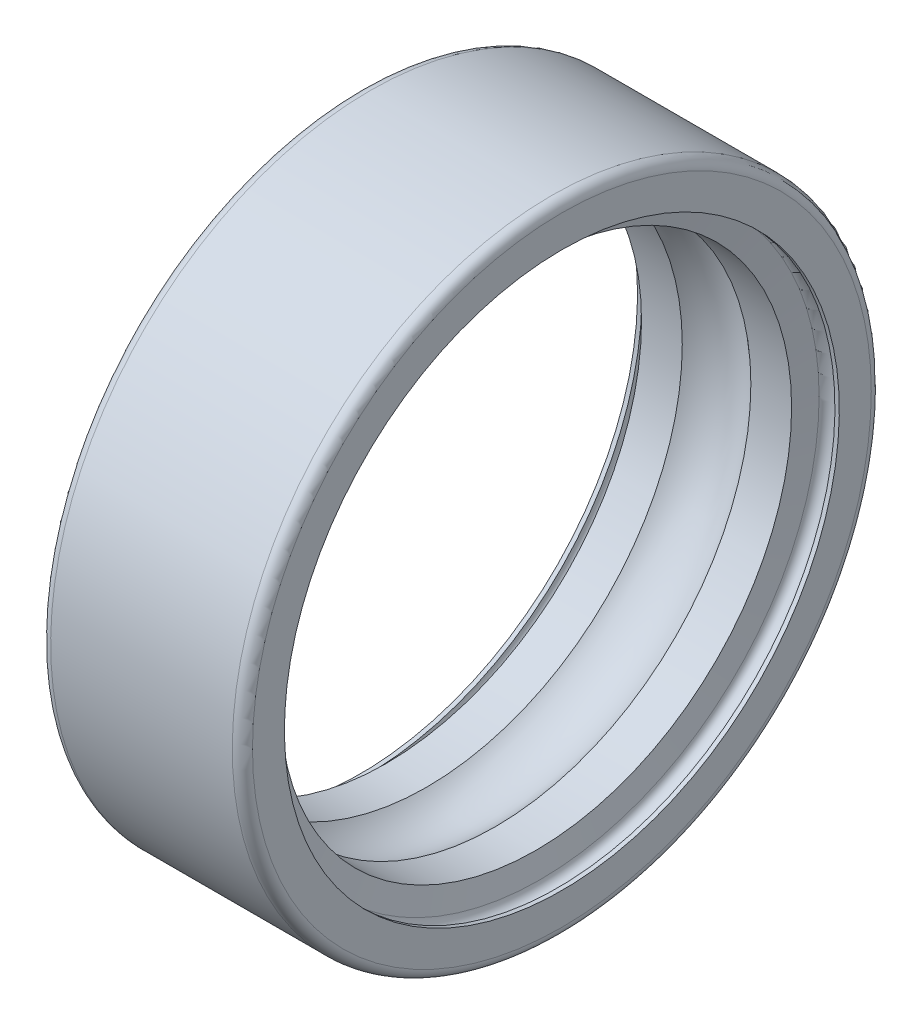
ISO-10303-21;
HEADER;
FILE_DESCRIPTION(('STEP AP214'),'2;1');
FILE_NAME('part.step','',(''),(''),'','','');
FILE_SCHEMA(('AUTOMOTIVE_DESIGN { 1 0 10303 214 1 1 1 1 }'));
ENDSEC;
DATA;
#1=APPLICATION_CONTEXT('core data for automotive mechanical design processes');
#2=APPLICATION_PROTOCOL_DEFINITION('international standard','automotive_design',2000,#1);
#3=PRODUCT_CONTEXT('',#1,'mechanical');
#4=PRODUCT('Part','Part','',(#3));
#5=PRODUCT_RELATED_PRODUCT_CATEGORY('part','',(#4));
#6=PRODUCT_DEFINITION_FORMATION('','',#4);
#7=PRODUCT_DEFINITION_CONTEXT('part definition',#1,'design');
#8=PRODUCT_DEFINITION('design','',#6,#7);
#9=PRODUCT_DEFINITION_SHAPE('','',#8);
#10=(LENGTH_UNIT() NAMED_UNIT(*) SI_UNIT(.MILLI.,.METRE.));
#11=(NAMED_UNIT(*) PLANE_ANGLE_UNIT() SI_UNIT($,.RADIAN.));
#12=(NAMED_UNIT(*) SI_UNIT($,.STERADIAN.) SOLID_ANGLE_UNIT());
#13=UNCERTAINTY_MEASURE_WITH_UNIT(LENGTH_MEASURE(1.E-05),#10,'distance_accuracy_value','');
#14=(GEOMETRIC_REPRESENTATION_CONTEXT(3) GLOBAL_UNCERTAINTY_ASSIGNED_CONTEXT((#13)) GLOBAL_UNIT_ASSIGNED_CONTEXT((#10,
#11,#12)) REPRESENTATION_CONTEXT('',''));
#15=CARTESIAN_POINT('',(0.,0.,0.));
#16=DIRECTION('',(0.,0.,1.));
#17=DIRECTION('',(1.,0.,0.));
#18=AXIS2_PLACEMENT_3D('',#15,#16,#17);
#19=CARTESIAN_POINT('',(5.61,0.,0.));
#20=DIRECTION('',(1.,0.,0.));
#21=DIRECTION('',(0.,0.,-1.));
#22=AXIS2_PLACEMENT_3D('',#19,#20,#21);
#23=TOROIDAL_SURFACE('',#22,8.25,0.26);
#24=CARTESIAN_POINT('',(5.87,0.,0.));
#25=DIRECTION('',(1.,0.,0.));
#26=DIRECTION('',(0.,1.,0.));
#27=AXIS2_PLACEMENT_3D('',#24,#25,#26);
#28=CIRCLE('',#27,8.25);
#29=CARTESIAN_POINT('',(5.87,8.25,0.));
#30=VERTEX_POINT('',#29);
#31=EDGE_CURVE('E11',#30,#30,#28,.T.);
#32=ORIENTED_EDGE('',*,*,#31,.T.);
#33=EDGE_LOOP('',(#32));
#34=FACE_BOUND('',#33,.T.);
#35=CARTESIAN_POINT('',(5.35394998421683,0.,0.));
#36=DIRECTION('',(1.,0.,0.));
#37=DIRECTION('',(0.,1.,0.));
#38=AXIS2_PLACEMENT_3D('',#35,#36,#37);
#39=CIRCLE('',#38,8.2951485261934);
#40=CARTESIAN_POINT('',(5.35394998421683,8.2951485261934,0.));
#41=VERTEX_POINT('',#40);
#42=EDGE_CURVE('E76',#41,#41,#39,.T.);
#43=ORIENTED_EDGE('',*,*,#42,.F.);
#44=EDGE_LOOP('',(#43));
#45=FACE_BOUND('',#44,.T.);
#46=ADVANCED_FACE('F16',(#34,#45),#23,.F.);
#47=CARTESIAN_POINT('',(5.935,0.,0.));
#48=DIRECTION('',(-1.,0.,0.));
#49=DIRECTION('',(0.,1.,0.));
#50=AXIS2_PLACEMENT_3D('',#47,#48,#49);
#51=CYLINDRICAL_SURFACE('',#50,8.25);
#52=CARTESIAN_POINT('',(6.,0.,0.));
#53=DIRECTION('',(1.,0.,0.));
#54=DIRECTION('',(0.,1.,0.));
#55=AXIS2_PLACEMENT_3D('',#52,#53,#54);
#56=CIRCLE('',#55,8.25);
#57=CARTESIAN_POINT('',(6.,8.25,0.));
#58=VERTEX_POINT('',#57);
#59=EDGE_CURVE('E25',#58,#58,#56,.T.);
#60=ORIENTED_EDGE('',*,*,#59,.T.);
#61=EDGE_LOOP('',(#60));
#62=FACE_BOUND('',#61,.T.);
#63=ORIENTED_EDGE('',*,*,#31,.F.);
#64=EDGE_LOOP('',(#63));
#65=FACE_BOUND('',#64,.T.);
#66=ADVANCED_FACE('F110',(#62,#65),#51,.F.);
#67=CARTESIAN_POINT('',(6.,8.725,0.));
#68=DIRECTION('',(1.,0.,0.));
#69=DIRECTION('',(0.,1.,0.));
#70=AXIS2_PLACEMENT_3D('',#67,#68,#69);
#71=PLANE('',#70);
#72=CARTESIAN_POINT('',(6.,0.,0.));
#73=DIRECTION('',(1.,0.,0.));
#74=DIRECTION('',(0.,1.,0.));
#75=AXIS2_PLACEMENT_3D('',#72,#73,#74);
#76=CIRCLE('',#75,9.2);
#77=CARTESIAN_POINT('',(6.,9.2,0.));
#78=VERTEX_POINT('',#77);
#79=EDGE_CURVE('E86',#78,#78,#76,.T.);
#80=ORIENTED_EDGE('',*,*,#79,.T.);
#81=EDGE_LOOP('',(#80));
#82=FACE_BOUND('',#81,.T.);
#83=ORIENTED_EDGE('',*,*,#59,.F.);
#84=EDGE_LOOP('',(#83));
#85=FACE_BOUND('',#84,.T.);
#86=ADVANCED_FACE('F115',(#82,#85),#71,.T.);
#87=CARTESIAN_POINT('',(5.7,0.,0.));
#88=DIRECTION('',(1.,0.,0.));
#89=DIRECTION('',(0.,0.,-1.));
#90=AXIS2_PLACEMENT_3D('',#87,#88,#89);
#91=TOROIDAL_SURFACE('',#90,9.2,0.3);
#92=CARTESIAN_POINT('',(5.7,0.,0.));
#93=DIRECTION('',(1.,0.,0.));
#94=DIRECTION('',(0.,1.,0.));
#95=AXIS2_PLACEMENT_3D('',#92,#93,#94);
#96=CIRCLE('',#95,9.5);
#97=CARTESIAN_POINT('',(5.7,9.5,0.));
#98=VERTEX_POINT('',#97);
#99=EDGE_CURVE('E84',#98,#98,#96,.T.);
#100=ORIENTED_EDGE('',*,*,#99,.T.);
#101=EDGE_LOOP('',(#100));
#102=FACE_BOUND('',#101,.T.);
#103=ORIENTED_EDGE('',*,*,#79,.F.);
#104=EDGE_LOOP('',(#103));
#105=FACE_BOUND('',#104,.T.);
#106=ADVANCED_FACE('F126',(#102,#105),#91,.T.);
#107=CARTESIAN_POINT('',(3.,0.,0.));
#108=DIRECTION('',(-1.,0.,0.));
#109=DIRECTION('',(0.,1.,0.));
#110=AXIS2_PLACEMENT_3D('',#107,#108,#109);
#111=CYLINDRICAL_SURFACE('',#110,9.5);
#112=CARTESIAN_POINT('',(0.3,0.,0.));
#113=DIRECTION('',(1.,0.,0.));
#114=DIRECTION('',(0.,1.,0.));
#115=AXIS2_PLACEMENT_3D('',#112,#113,#114);
#116=CIRCLE('',#115,9.5);
#117=CARTESIAN_POINT('',(0.3,9.5,0.));
#118=VERTEX_POINT('',#117);
#119=EDGE_CURVE('E93',#118,#118,#116,.T.);
#120=ORIENTED_EDGE('',*,*,#119,.T.);
#121=EDGE_LOOP('',(#120));
#122=FACE_BOUND('',#121,.T.);
#123=ORIENTED_EDGE('',*,*,#99,.F.);
#124=EDGE_LOOP('',(#123));
#125=FACE_BOUND('',#124,.T.);
#126=ADVANCED_FACE('F128',(#122,#125),#111,.T.);
#127=CARTESIAN_POINT('',(0.3,0.,0.));
#128=DIRECTION('',(1.,0.,0.));
#129=DIRECTION('',(0.,0.,-1.));
#130=AXIS2_PLACEMENT_3D('',#127,#128,#129);
#131=TOROIDAL_SURFACE('',#130,9.2,0.3);
#132=CARTESIAN_POINT('',(0.,0.,0.));
#133=DIRECTION('',(1.,0.,0.));
#134=DIRECTION('',(0.,1.,0.));
#135=AXIS2_PLACEMENT_3D('',#132,#133,#134);
#136=CIRCLE('',#135,9.2);
#137=CARTESIAN_POINT('',(0.,9.2,0.));
#138=VERTEX_POINT('',#137);
#139=EDGE_CURVE('E90',#138,#138,#136,.T.);
#140=ORIENTED_EDGE('',*,*,#139,.T.);
#141=EDGE_LOOP('',(#140));
#142=FACE_BOUND('',#141,.T.);
#143=ORIENTED_EDGE('',*,*,#119,.F.);
#144=EDGE_LOOP('',(#143));
#145=FACE_BOUND('',#144,.T.);
#146=ADVANCED_FACE('F133',(#142,#145),#131,.T.);
#147=CARTESIAN_POINT('',(0.,8.725,0.));
#148=DIRECTION('',(-1.,0.,0.));
#149=DIRECTION('',(0.,-1.,0.));
#150=AXIS2_PLACEMENT_3D('',#147,#148,#149);
#151=PLANE('',#150);
#152=CARTESIAN_POINT('',(0.,0.,0.));
#153=DIRECTION('',(1.,0.,0.));
#154=DIRECTION('',(0.,1.,0.));
#155=AXIS2_PLACEMENT_3D('',#152,#153,#154);
#156=CIRCLE('',#155,8.25);
#157=CARTESIAN_POINT('',(0.,8.25,0.));
#158=VERTEX_POINT('',#157);
#159=EDGE_CURVE('E88',#158,#158,#156,.T.);
#160=ORIENTED_EDGE('',*,*,#159,.T.);
#161=EDGE_LOOP('',(#160));
#162=FACE_BOUND('',#161,.T.);
#163=ORIENTED_EDGE('',*,*,#139,.F.);
#164=EDGE_LOOP('',(#163));
#165=FACE_BOUND('',#164,.T.);
#166=ADVANCED_FACE('F124',(#162,#165),#151,.T.);
#167=CARTESIAN_POINT('',(0.065,0.,0.));
#168=DIRECTION('',(-1.,0.,0.));
#169=DIRECTION('',(0.,1.,0.));
#170=AXIS2_PLACEMENT_3D('',#167,#168,#169);
#171=CYLINDRICAL_SURFACE('',#170,8.25);
#172=CARTESIAN_POINT('',(0.13,0.,0.));
#173=DIRECTION('',(1.,0.,0.));
#174=DIRECTION('',(0.,1.,0.));
#175=AXIS2_PLACEMENT_3D('',#172,#173,#174);
#176=CIRCLE('',#175,8.25);
#177=CARTESIAN_POINT('',(0.13,8.25,0.));
#178=VERTEX_POINT('',#177);
#179=EDGE_CURVE('E91',#178,#178,#176,.T.);
#180=ORIENTED_EDGE('',*,*,#179,.T.);
#181=EDGE_LOOP('',(#180));
#182=FACE_BOUND('',#181,.T.);
#183=ORIENTED_EDGE('',*,*,#159,.F.);
#184=EDGE_LOOP('',(#183));
#185=FACE_BOUND('',#184,.T.);
#186=ADVANCED_FACE('F120',(#182,#185),#171,.F.);
#187=CARTESIAN_POINT('',(0.39,0.,0.));
#188=DIRECTION('',(1.,0.,0.));
#189=DIRECTION('',(0.,0.,-1.));
#190=AXIS2_PLACEMENT_3D('',#187,#188,#189);
#191=TOROIDAL_SURFACE('',#190,8.25,0.26);
#192=CARTESIAN_POINT('',(0.646050015783174,0.,0.));
#193=DIRECTION('',(1.,0.,0.));
#194=DIRECTION('',(0.,1.,0.));
#195=AXIS2_PLACEMENT_3D('',#192,#193,#194);
#196=CIRCLE('',#195,8.2951485261934);
#197=CARTESIAN_POINT('',(0.646050015783174,8.2951485261934,0.));
#198=VERTEX_POINT('',#197);
#199=EDGE_CURVE('E20',#198,#198,#196,.T.);
#200=ORIENTED_EDGE('',*,*,#199,.T.);
#201=EDGE_LOOP('',(#200));
#202=FACE_BOUND('',#201,.T.);
#203=ORIENTED_EDGE('',*,*,#179,.F.);
#204=EDGE_LOOP('',(#203));
#205=FACE_BOUND('',#204,.T.);
#206=ADVANCED_FACE('F123',(#202,#205),#191,.F.);
#207=CARTESIAN_POINT('',(0.707336736166986,0.,0.));
#208=DIRECTION('',(-1.,0.,0.));
#209=DIRECTION('',(0.,1.,0.));
#210=AXIS2_PLACEMENT_3D('',#207,#208,#209);
#211=CONICAL_SURFACE('',#210,7.9475742630967,1.39626340159546);
#212=CARTESIAN_POINT('',(0.768623456550796,0.,0.));
#213=DIRECTION('',(1.,0.,0.));
#214=DIRECTION('',(0.,1.,0.));
#215=AXIS2_PLACEMENT_3D('',#212,#213,#214);
#216=CIRCLE('',#215,7.6);
#217=CARTESIAN_POINT('',(0.768623456550797,7.6,0.));
#218=VERTEX_POINT('',#217);
#219=EDGE_CURVE('E78',#218,#218,#216,.T.);
#220=ORIENTED_EDGE('',*,*,#219,.T.);
#221=EDGE_LOOP('',(#220));
#222=FACE_BOUND('',#221,.T.);
#223=ORIENTED_EDGE('',*,*,#199,.F.);
#224=EDGE_LOOP('',(#223));
#225=FACE_BOUND('',#224,.T.);
#226=ADVANCED_FACE('F18',(#222,#225),#211,.F.);
#227=CARTESIAN_POINT('',(1.37440977691612,0.,0.));
#228=DIRECTION('',(-1.,0.,0.));
#229=DIRECTION('',(0.,1.,0.));
#230=AXIS2_PLACEMENT_3D('',#227,#228,#229);
#231=CYLINDRICAL_SURFACE('',#230,7.6);
#232=CARTESIAN_POINT('',(1.98019609728145,0.,0.));
#233=DIRECTION('',(1.,0.,0.));
#234=DIRECTION('',(0.,1.,0.));
#235=AXIS2_PLACEMENT_3D('',#232,#233,#234);
#236=CIRCLE('',#235,7.6);
#237=CARTESIAN_POINT('',(1.98019609728145,7.6,0.));
#238=VERTEX_POINT('',#237);
#239=EDGE_CURVE('E75',#238,#238,#236,.T.);
#240=ORIENTED_EDGE('',*,*,#239,.T.);
#241=EDGE_LOOP('',(#240));
#242=FACE_BOUND('',#241,.T.);
#243=ORIENTED_EDGE('',*,*,#219,.F.);
#244=EDGE_LOOP('',(#243));
#245=FACE_BOUND('',#244,.T.);
#246=ADVANCED_FACE('F135',(#242,#245),#231,.F.);
#247=CARTESIAN_POINT('',(3.,0.,0.));
#248=DIRECTION('',(1.,0.,0.));
#249=DIRECTION('',(0.,0.,-1.));
#250=AXIS2_PLACEMENT_3D('',#247,#248,#249);
#251=TOROIDAL_SURFACE('',#250,6.5,1.5);
#252=CARTESIAN_POINT('',(4.01980390271856,0.,0.));
#253=DIRECTION('',(1.,0.,0.));
#254=DIRECTION('',(0.,1.,0.));
#255=AXIS2_PLACEMENT_3D('',#252,#253,#254);
#256=CIRCLE('',#255,7.6);
#257=CARTESIAN_POINT('',(4.01980390271856,7.6,0.));
#258=VERTEX_POINT('',#257);
#259=EDGE_CURVE('E71',#258,#258,#256,.T.);
#260=ORIENTED_EDGE('',*,*,#259,.T.);
#261=EDGE_LOOP('',(#260));
#262=FACE_BOUND('',#261,.T.);
#263=ORIENTED_EDGE('',*,*,#239,.F.);
#264=EDGE_LOOP('',(#263));
#265=FACE_BOUND('',#264,.T.);
#266=ADVANCED_FACE('F72',(#262,#265),#251,.F.);
#267=CARTESIAN_POINT('',(4.62559022308388,0.,0.));
#268=DIRECTION('',(-1.,0.,0.));
#269=DIRECTION('',(0.,1.,0.));
#270=AXIS2_PLACEMENT_3D('',#267,#268,#269);
#271=CYLINDRICAL_SURFACE('',#270,7.6);
#272=CARTESIAN_POINT('',(5.2313765434492,0.,0.));
#273=DIRECTION('',(1.,0.,0.));
#274=DIRECTION('',(0.,1.,0.));
#275=AXIS2_PLACEMENT_3D('',#272,#273,#274);
#276=CIRCLE('',#275,7.6);
#277=CARTESIAN_POINT('',(5.2313765434492,7.6,0.));
#278=VERTEX_POINT('',#277);
#279=EDGE_CURVE('E80',#278,#278,#276,.T.);
#280=ORIENTED_EDGE('',*,*,#279,.T.);
#281=EDGE_LOOP('',(#280));
#282=FACE_BOUND('',#281,.T.);
#283=ORIENTED_EDGE('',*,*,#259,.F.);
#284=EDGE_LOOP('',(#283));
#285=FACE_BOUND('',#284,.T.);
#286=ADVANCED_FACE('F97',(#282,#285),#271,.F.);
#287=CARTESIAN_POINT('',(5.29266326383301,0.,0.));
#288=DIRECTION('',(1.,0.,0.));
#289=DIRECTION('',(0.,1.,0.));
#290=AXIS2_PLACEMENT_3D('',#287,#288,#289);
#291=CONICAL_SURFACE('',#290,7.9475742630967,1.39626340159546);
#292=ORIENTED_EDGE('',*,*,#42,.T.);
#293=EDGE_LOOP('',(#292));
#294=FACE_BOUND('',#293,.T.);
#295=ORIENTED_EDGE('',*,*,#279,.F.);
#296=EDGE_LOOP('',(#295));
#297=FACE_BOUND('',#296,.T.);
#298=ADVANCED_FACE('F99',(#294,#297),#291,.F.);
#299=CLOSED_SHELL('',(#46,#66,#86,#106,#126,#146,#166,#186,#206,#226,#246,#266,#286,#298));
#300=MANIFOLD_SOLID_BREP('B1',#299);
#301=ADVANCED_BREP_SHAPE_REPRESENTATION('',(#18,#300),#14);
#302=SHAPE_DEFINITION_REPRESENTATION(#9,#301);
ENDSEC;
END-ISO-10303-21;
